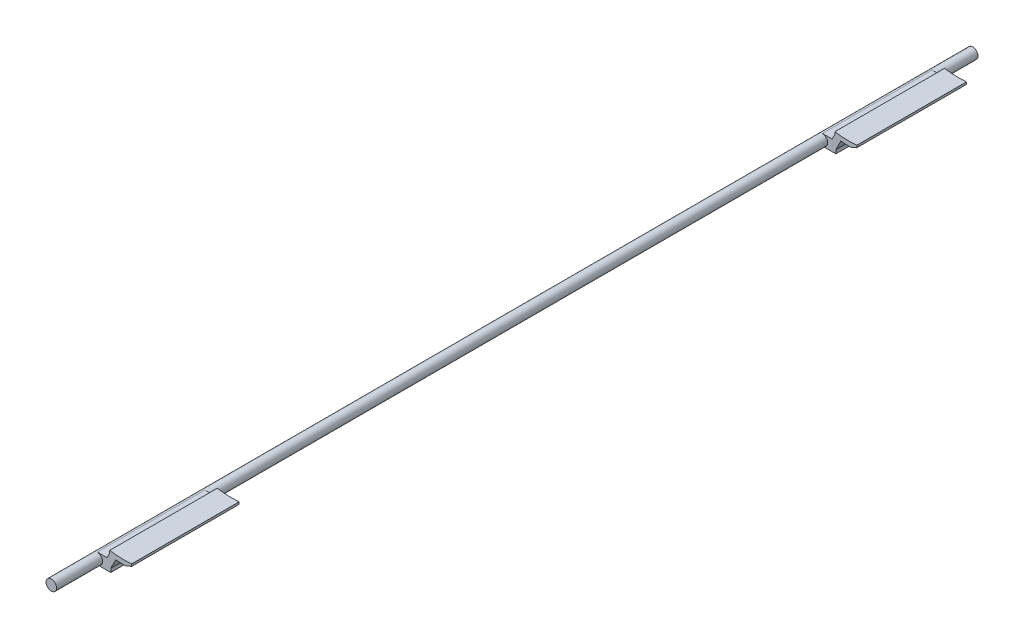
ISO-10303-21;
HEADER;
FILE_DESCRIPTION(('STEP AP214'),'2;1');
FILE_NAME('part.step','',(''),(''),'','','');
FILE_SCHEMA(('AUTOMOTIVE_DESIGN { 1 0 10303 214 1 1 1 1 }'));
ENDSEC;
DATA;
#1=APPLICATION_CONTEXT('core data for automotive mechanical design processes');
#2=APPLICATION_PROTOCOL_DEFINITION('international standard','automotive_design',2000,#1);
#3=PRODUCT_CONTEXT('',#1,'mechanical');
#4=PRODUCT('Part','Part','',(#3));
#5=PRODUCT_RELATED_PRODUCT_CATEGORY('part','',(#4));
#6=PRODUCT_DEFINITION_FORMATION('','',#4);
#7=PRODUCT_DEFINITION_CONTEXT('part definition',#1,'design');
#8=PRODUCT_DEFINITION('design','',#6,#7);
#9=PRODUCT_DEFINITION_SHAPE('','',#8);
#10=(LENGTH_UNIT() NAMED_UNIT(*) SI_UNIT(.MILLI.,.METRE.));
#11=(NAMED_UNIT(*) PLANE_ANGLE_UNIT() SI_UNIT($,.RADIAN.));
#12=(NAMED_UNIT(*) SI_UNIT($,.STERADIAN.) SOLID_ANGLE_UNIT());
#13=UNCERTAINTY_MEASURE_WITH_UNIT(LENGTH_MEASURE(1.E-05),#10,'distance_accuracy_value','');
#14=(GEOMETRIC_REPRESENTATION_CONTEXT(3) GLOBAL_UNCERTAINTY_ASSIGNED_CONTEXT((#13)) GLOBAL_UNIT_ASSIGNED_CONTEXT((#10,
#11,#12)) REPRESENTATION_CONTEXT('',''));
#15=CARTESIAN_POINT('',(0.,0.,0.));
#16=DIRECTION('',(0.,0.,1.));
#17=DIRECTION('',(1.,0.,0.));
#18=AXIS2_PLACEMENT_3D('',#15,#16,#17);
#19=CARTESIAN_POINT('',(-12.,-45.0038053254239,70.));
#20=DIRECTION('',(0.,0.,-1.));
#21=DIRECTION('',(-1.,0.,0.));
#22=AXIS2_PLACEMENT_3D('',#19,#20,#21);
#23=CYLINDRICAL_SURFACE('',#22,2.4);
#24=CARTESIAN_POINT('',(-12.,-45.0038053254239,-331.5));
#25=DIRECTION('',(0.,0.,1.));
#26=DIRECTION('',(-1.,0.,0.));
#27=AXIS2_PLACEMENT_3D('',#24,#25,#26);
#28=CIRCLE('',#27,2.4);
#29=CARTESIAN_POINT('',(-12.,-47.4038053254239,-331.5));
#30=VERTEX_POINT('',#29);
#31=CARTESIAN_POINT('',(-12.,-42.6038053254239,-331.5));
#32=VERTEX_POINT('',#31);
#33=EDGE_CURVE('E270',#30,#32,#28,.T.);
#34=ORIENTED_EDGE('',*,*,#33,.F.);
#35=DIRECTION('',(0.,0.,1.));
#36=VECTOR('',#35,1.);
#37=CARTESIAN_POINT('',(-12.,-47.4038053254239,-331.5));
#38=LINE('',#37,#36);
#39=CARTESIAN_POINT('',(-12.,-47.4038053254239,-281.5));
#40=VERTEX_POINT('',#39);
#41=EDGE_CURVE('E348',#30,#40,#38,.T.);
#42=ORIENTED_EDGE('',*,*,#41,.T.);
#43=CARTESIAN_POINT('',(-12.,-45.0038053254239,-281.5));
#44=DIRECTION('',(0.,0.,1.));
#45=DIRECTION('',(-1.,0.,0.));
#46=AXIS2_PLACEMENT_3D('',#43,#44,#45);
#47=CIRCLE('',#46,2.4);
#48=CARTESIAN_POINT('',(-12.,-42.6038053254239,-281.5));
#49=VERTEX_POINT('',#48);
#50=EDGE_CURVE('E294',#40,#49,#47,.T.);
#51=ORIENTED_EDGE('',*,*,#50,.T.);
#52=DIRECTION('',(0.,0.,1.));
#53=VECTOR('',#52,1.);
#54=CARTESIAN_POINT('',(-12.,-42.6038053254239,-331.5));
#55=LINE('',#54,#53);
#56=EDGE_CURVE('E345',#32,#49,#55,.T.);
#57=ORIENTED_EDGE('',*,*,#56,.F.);
#58=EDGE_LOOP('',(#34,#42,#51,#57));
#59=FACE_BOUND('',#58,.T.);
#60=CARTESIAN_POINT('',(-12.,-45.0038053254239,49.));
#61=DIRECTION('',(0.,0.,1.));
#62=DIRECTION('',(1.,0.,0.));
#63=AXIS2_PLACEMENT_3D('',#60,#61,#62);
#64=CIRCLE('',#63,2.4);
#65=CARTESIAN_POINT('',(-12.,-47.4038053254239,49.));
#66=VERTEX_POINT('',#65);
#67=CARTESIAN_POINT('',(-12.,-42.6038053254239,49.));
#68=VERTEX_POINT('',#67);
#69=EDGE_CURVE('E362',#66,#68,#64,.T.);
#70=ORIENTED_EDGE('',*,*,#69,.T.);
#71=DIRECTION('',(0.,0.,-1.));
#72=VECTOR('',#71,1.);
#73=CARTESIAN_POINT('',(-12.,-42.6038053254239,70.));
#74=LINE('',#73,#72);
#75=CARTESIAN_POINT('',(-12.,-42.6038053254239,0.));
#76=VERTEX_POINT('',#75);
#77=EDGE_CURVE('E11',#68,#76,#74,.T.);
#78=ORIENTED_EDGE('',*,*,#77,.T.);
#79=CARTESIAN_POINT('',(-12.,-45.0038053254239,0.));
#80=DIRECTION('',(0.,0.,1.));
#81=DIRECTION('',(1.,0.,0.));
#82=AXIS2_PLACEMENT_3D('',#79,#80,#81);
#83=CIRCLE('',#82,2.4);
#84=CARTESIAN_POINT('',(-12.,-47.4038053254239,0.));
#85=VERTEX_POINT('',#84);
#86=EDGE_CURVE('E360',#85,#76,#83,.T.);
#87=ORIENTED_EDGE('',*,*,#86,.F.);
#88=DIRECTION('',(0.,0.,-1.));
#89=VECTOR('',#88,1.);
#90=CARTESIAN_POINT('',(-12.,-47.4038053254239,70.));
#91=LINE('',#90,#89);
#92=EDGE_CURVE('E46',#85,#66,#91,.F.);
#93=ORIENTED_EDGE('',*,*,#92,.T.);
#94=EDGE_LOOP('',(#70,#78,#87,#93));
#95=FACE_BOUND('',#94,.T.);
#96=CARTESIAN_POINT('',(-12.,-45.0038053254239,70.));
#97=DIRECTION('',(0.,0.,-1.));
#98=DIRECTION('',(-1.,0.,0.));
#99=AXIS2_PLACEMENT_3D('',#96,#97,#98);
#100=CIRCLE('',#99,2.4);
#101=CARTESIAN_POINT('',(-14.4,-45.0038053254239,70.));
#102=VERTEX_POINT('',#101);
#103=EDGE_CURVE('E357',#102,#102,#100,.T.);
#104=ORIENTED_EDGE('',*,*,#103,.T.);
#105=EDGE_LOOP('',(#104));
#106=FACE_BOUND('',#105,.T.);
#107=CARTESIAN_POINT('',(-12.,-45.0038053254239,-350.));
#108=DIRECTION('',(0.,0.,-1.));
#109=DIRECTION('',(-1.,0.,0.));
#110=AXIS2_PLACEMENT_3D('',#107,#108,#109);
#111=CIRCLE('',#110,2.4);
#112=CARTESIAN_POINT('',(-14.4,-45.0038053254239,-350.));
#113=VERTEX_POINT('',#112);
#114=EDGE_CURVE('E354',#113,#113,#111,.T.);
#115=ORIENTED_EDGE('',*,*,#114,.F.);
#116=EDGE_LOOP('',(#115));
#117=FACE_BOUND('',#116,.T.);
#118=CARTESIAN_POINT('',(-12.,-45.0038053254239,-142.75));
#119=DIRECTION('',(0.,0.,1.));
#120=DIRECTION('',(-1.,0.,0.));
#121=AXIS2_PLACEMENT_3D('',#118,#119,#120);
#122=CIRCLE('',#121,2.4);
#123=CARTESIAN_POINT('',(-14.1477070839968,-46.0749515719047,-142.75));
#124=VERTEX_POINT('',#123);
#125=CARTESIAN_POINT('',(-11.6077130988425,-47.37152806831,-142.75));
#126=VERTEX_POINT('',#125);
#127=EDGE_CURVE('E53',#124,#126,#122,.T.);
#128=ORIENTED_EDGE('',*,*,#127,.F.);
#129=DIRECTION('',(0.,0.,1.));
#130=VECTOR('',#129,1.);
#131=CARTESIAN_POINT('',(-14.1477070839968,-46.0749515719047,-142.75));
#132=LINE('',#131,#130);
#133=CARTESIAN_POINT('',(-14.1477070839968,-46.0749515719047,-140.75));
#134=VERTEX_POINT('',#133);
#135=EDGE_CURVE('E58',#124,#134,#132,.T.);
#136=ORIENTED_EDGE('',*,*,#135,.T.);
#137=CARTESIAN_POINT('',(-12.,-45.0038053254239,-140.75));
#138=DIRECTION('',(0.,0.,1.));
#139=DIRECTION('',(-1.,0.,0.));
#140=AXIS2_PLACEMENT_3D('',#137,#138,#139);
#141=CIRCLE('',#140,2.4);
#142=CARTESIAN_POINT('',(-11.6077130988425,-47.37152806831,-140.75));
#143=VERTEX_POINT('',#142);
#144=EDGE_CURVE('E627',#134,#143,#141,.T.);
#145=ORIENTED_EDGE('',*,*,#144,.T.);
#146=DIRECTION('',(0.,0.,1.));
#147=VECTOR('',#146,1.);
#148=CARTESIAN_POINT('',(-11.6077130988425,-47.37152806831,-142.75));
#149=LINE('',#148,#147);
#150=EDGE_CURVE('E260',#126,#143,#149,.T.);
#151=ORIENTED_EDGE('',*,*,#150,.F.);
#152=EDGE_LOOP('',(#128,#136,#145,#151));
#153=FACE_BOUND('',#152,.T.);
#154=ADVANCED_FACE('F37',(#59,#95,#106,#117,#153),#23,.T.);
#155=CARTESIAN_POINT('',(-12.,0.,0.));
#156=DIRECTION('',(-1.,0.,0.));
#157=DIRECTION('',(0.,0.,1.));
#158=AXIS2_PLACEMENT_3D('',#155,#156,#157);
#159=PLANE('',#158);
#160=ORIENTED_EDGE('',*,*,#77,.F.);
#161=DIRECTION('',(0.,-1.,0.));
#162=VECTOR('',#161,1.);
#163=CARTESIAN_POINT('',(-12.,-42.5038053254239,49.));
#164=LINE('',#163,#162);
#165=CARTESIAN_POINT('',(-12.,-42.5038053254239,49.));
#166=VERTEX_POINT('',#165);
#167=EDGE_CURVE('E382',#166,#68,#164,.T.);
#168=ORIENTED_EDGE('',*,*,#167,.F.);
#169=DIRECTION('',(0.,0.,1.));
#170=VECTOR('',#169,1.);
#171=CARTESIAN_POINT('',(-12.,-42.5038053254239,0.));
#172=LINE('',#171,#170);
#173=CARTESIAN_POINT('',(-12.,-42.5038053254239,0.));
#174=VERTEX_POINT('',#173);
#175=EDGE_CURVE('E378',#174,#166,#172,.T.);
#176=ORIENTED_EDGE('',*,*,#175,.F.);
#177=DIRECTION('',(0.,1.,0.));
#178=VECTOR('',#177,1.);
#179=CARTESIAN_POINT('',(-12.,-42.5038053254239,0.));
#180=LINE('',#179,#178);
#181=EDGE_CURVE('E365',#76,#174,#180,.T.);
#182=ORIENTED_EDGE('',*,*,#181,.F.);
#183=EDGE_LOOP('',(#160,#168,#176,#182));
#184=FACE_BOUND('',#183,.T.);
#185=ADVANCED_FACE('F478',(#184),#159,.T.);
#186=CARTESIAN_POINT('',(-8.5584908278383,-44.4973356573606,49.));
#187=DIRECTION('',(0.897224309500206,-0.441575065466652,0.));
#188=DIRECTION('',(0.441575065466652,0.897224309500206,0.));
#189=AXIS2_PLACEMENT_3D('',#186,#187,#188);
#190=PLANE('',#189);
#191=DIRECTION('',(0.,0.,-1.));
#192=VECTOR('',#191,1.);
#193=CARTESIAN_POINT('',(-7.57736127359667,-42.5038053254239,49.));
#194=LINE('',#193,#192);
#195=CARTESIAN_POINT('',(-7.57736127359666,-42.5038053254239,49.));
#196=VERTEX_POINT('',#195);
#197=CARTESIAN_POINT('',(-7.57736127359666,-42.5038053254239,0.));
#198=VERTEX_POINT('',#197);
#199=EDGE_CURVE('E450',#196,#198,#194,.T.);
#200=ORIENTED_EDGE('',*,*,#199,.F.);
#201=DIRECTION('',(0.441575065466652,0.897224309500206,0.));
#202=VECTOR('',#201,1.);
#203=CARTESIAN_POINT('',(-8.5584908278383,-44.4973356573606,49.));
#204=LINE('',#203,#202);
#205=CARTESIAN_POINT('',(-6.35061550050504,-40.0112141098596,49.));
#206=VERTEX_POINT('',#205);
#207=EDGE_CURVE('E403',#196,#206,#204,.T.);
#208=ORIENTED_EDGE('',*,*,#207,.T.);
#209=DIRECTION('',(0.,0.,1.));
#210=VECTOR('',#209,1.);
#211=CARTESIAN_POINT('',(-6.35061550050505,-40.0112141098596,49.));
#212=LINE('',#211,#210);
#213=CARTESIAN_POINT('',(-6.35061550050504,-40.0112141098596,0.));
#214=VERTEX_POINT('',#213);
#215=EDGE_CURVE('E447',#214,#206,#212,.T.);
#216=ORIENTED_EDGE('',*,*,#215,.F.);
#217=DIRECTION('',(0.441575065466652,0.897224309500206,0.));
#218=VECTOR('',#217,1.);
#219=CARTESIAN_POINT('',(-8.5584908278383,-44.4973356573606,0.));
#220=LINE('',#219,#218);
#221=EDGE_CURVE('E401',#198,#214,#220,.T.);
#222=ORIENTED_EDGE('',*,*,#221,.F.);
#223=EDGE_LOOP('',(#200,#208,#216,#222));
#224=FACE_BOUND('',#223,.T.);
#225=ADVANCED_FACE('F483',(#224),#190,.F.);
#226=CARTESIAN_POINT('',(0.,0.,49.));
#227=DIRECTION('',(0.,0.,-1.));
#228=DIRECTION('',(-1.,0.,0.));
#229=AXIS2_PLACEMENT_3D('',#226,#227,#228);
#230=CYLINDRICAL_SURFACE('',#229,39.5);
#231=CARTESIAN_POINT('',(0.,0.,0.));
#232=DIRECTION('',(0.,0.,-1.));
#233=DIRECTION('',(1.,0.,0.));
#234=AXIS2_PLACEMENT_3D('',#231,#232,#233);
#235=CIRCLE('',#234,39.5);
#236=CARTESIAN_POINT('',(3.64938449949495,-39.3310563394227,0.));
#237=VERTEX_POINT('',#236);
#238=CARTESIAN_POINT('',(-6.35061550050505,-38.9861473188201,0.));
#239=VERTEX_POINT('',#238);
#240=EDGE_CURVE('E407',#237,#239,#235,.T.);
#241=ORIENTED_EDGE('',*,*,#240,.T.);
#242=DIRECTION('',(0.,0.,-1.));
#243=VECTOR('',#242,1.);
#244=CARTESIAN_POINT('',(-6.35061550050505,-38.9861473188201,49.));
#245=LINE('',#244,#243);
#246=CARTESIAN_POINT('',(-6.35061550050505,-38.9861473188201,49.));
#247=VERTEX_POINT('',#246);
#248=EDGE_CURVE('E430',#247,#239,#245,.T.);
#249=ORIENTED_EDGE('',*,*,#248,.F.);
#250=CARTESIAN_POINT('',(0.,0.,49.));
#251=DIRECTION('',(0.,0.,-1.));
#252=DIRECTION('',(1.,0.,0.));
#253=AXIS2_PLACEMENT_3D('',#250,#251,#252);
#254=CIRCLE('',#253,39.5);
#255=CARTESIAN_POINT('',(3.64938449949495,-39.3310563394227,49.));
#256=VERTEX_POINT('',#255);
#257=EDGE_CURVE('E408',#256,#247,#254,.T.);
#258=ORIENTED_EDGE('',*,*,#257,.F.);
#259=DIRECTION('',(0.,0.,-1.));
#260=VECTOR('',#259,1.);
#261=CARTESIAN_POINT('',(3.64938449949495,-39.3310563394227,49.));
#262=LINE('',#261,#260);
#263=EDGE_CURVE('E419',#256,#237,#262,.T.);
#264=ORIENTED_EDGE('',*,*,#263,.T.);
#265=EDGE_LOOP('',(#241,#249,#258,#264));
#266=FACE_BOUND('',#265,.T.);
#267=ADVANCED_FACE('F492',(#266),#230,.F.);
#268=CARTESIAN_POINT('',(-6.35061550050505,-38.9861473188201,49.));
#269=DIRECTION('',(1.,0.,0.));
#270=DIRECTION('',(0.,0.,-1.));
#271=AXIS2_PLACEMENT_3D('',#268,#269,#270);
#272=PLANE('',#271);
#273=DIRECTION('',(0.,-1.,0.));
#274=VECTOR('',#273,1.);
#275=CARTESIAN_POINT('',(-6.35061550050505,-38.9861473188201,0.));
#276=LINE('',#275,#274);
#277=EDGE_CURVE('E422',#239,#214,#276,.T.);
#278=ORIENTED_EDGE('',*,*,#277,.T.);
#279=ORIENTED_EDGE('',*,*,#215,.T.);
#280=DIRECTION('',(0.,-1.,0.));
#281=VECTOR('',#280,1.);
#282=CARTESIAN_POINT('',(-6.35061550050505,-38.9861473188201,49.));
#283=LINE('',#282,#281);
#284=EDGE_CURVE('E411',#247,#206,#283,.T.);
#285=ORIENTED_EDGE('',*,*,#284,.F.);
#286=ORIENTED_EDGE('',*,*,#248,.T.);
#287=EDGE_LOOP('',(#278,#279,#285,#286));
#288=FACE_BOUND('',#287,.T.);
#289=ADVANCED_FACE('F488',(#288),#272,.F.);
#290=CARTESIAN_POINT('',(0.,0.,49.));
#291=DIRECTION('',(0.,0.,-1.));
#292=DIRECTION('',(-1.,0.,0.));
#293=AXIS2_PLACEMENT_3D('',#290,#291,#292);
#294=CYLINDRICAL_SURFACE('',#293,41.5);
#295=CARTESIAN_POINT('',(0.,0.,49.));
#296=DIRECTION('',(0.,0.,1.));
#297=DIRECTION('',(1.,0.,0.));
#298=AXIS2_PLACEMENT_3D('',#295,#296,#297);
#299=CIRCLE('',#298,41.5);
#300=CARTESIAN_POINT('',(-3.65288271390052,-41.3389217067703,49.));
#301=VERTEX_POINT('',#300);
#302=CARTESIAN_POINT('',(0.929260094521954,-41.4895947880517,49.));
#303=VERTEX_POINT('',#302);
#304=EDGE_CURVE('E415',#301,#303,#299,.T.);
#305=ORIENTED_EDGE('',*,*,#304,.F.);
#306=DIRECTION('',(0.,0.,-1.));
#307=VECTOR('',#306,1.);
#308=CARTESIAN_POINT('',(-3.65288271390053,-41.3389217067703,49.));
#309=LINE('',#308,#307);
#310=CARTESIAN_POINT('',(-3.65288271390053,-41.3389217067703,0.));
#311=VERTEX_POINT('',#310);
#312=EDGE_CURVE('E444',#301,#311,#309,.T.);
#313=ORIENTED_EDGE('',*,*,#312,.T.);
#314=CARTESIAN_POINT('',(0.,0.,0.));
#315=DIRECTION('',(0.,0.,1.));
#316=DIRECTION('',(1.,0.,0.));
#317=AXIS2_PLACEMENT_3D('',#314,#315,#316);
#318=CIRCLE('',#317,41.5);
#319=CARTESIAN_POINT('',(0.929260094521954,-41.4895947880517,0.));
#320=VERTEX_POINT('',#319);
#321=EDGE_CURVE('E425',#311,#320,#318,.T.);
#322=ORIENTED_EDGE('',*,*,#321,.T.);
#323=DIRECTION('',(0.,0.,-1.));
#324=VECTOR('',#323,1.);
#325=CARTESIAN_POINT('',(0.929260094521954,-41.4895947880517,49.));
#326=LINE('',#325,#324);
#327=EDGE_CURVE('E439',#320,#303,#326,.F.);
#328=ORIENTED_EDGE('',*,*,#327,.T.);
#329=EDGE_LOOP('',(#305,#313,#322,#328));
#330=FACE_BOUND('',#329,.T.);
#331=ADVANCED_FACE('F505',(#330),#294,.T.);
#332=CARTESIAN_POINT('',(3.64938449949495,-39.3310563394227,49.));
#333=DIRECTION('',(-1.,0.,0.));
#334=DIRECTION('',(0.,-1.,0.));
#335=AXIS2_PLACEMENT_3D('',#332,#333,#334);
#336=PLANE('',#335);
#337=DIRECTION('',(0.,1.,0.));
#338=VECTOR('',#337,1.);
#339=CARTESIAN_POINT('',(3.64938449949495,-39.3310563394227,49.));
#340=LINE('',#339,#338);
#341=CARTESIAN_POINT('',(3.64938449949495,-40.3392306746854,49.));
#342=VERTEX_POINT('',#341);
#343=EDGE_CURVE('E417',#342,#256,#340,.T.);
#344=ORIENTED_EDGE('',*,*,#343,.F.);
#345=DIRECTION('',(0.,0.,-1.));
#346=VECTOR('',#345,1.);
#347=CARTESIAN_POINT('',(3.64938449949495,-40.3392306746854,49.));
#348=LINE('',#347,#346);
#349=CARTESIAN_POINT('',(3.64938449949495,-40.3392306746854,0.));
#350=VERTEX_POINT('',#349);
#351=EDGE_CURVE('E433',#342,#350,#348,.T.);
#352=ORIENTED_EDGE('',*,*,#351,.T.);
#353=DIRECTION('',(0.,1.,0.));
#354=VECTOR('',#353,1.);
#355=CARTESIAN_POINT('',(3.64938449949495,-39.3310563394227,0.));
#356=LINE('',#355,#354);
#357=EDGE_CURVE('E412',#350,#237,#356,.T.);
#358=ORIENTED_EDGE('',*,*,#357,.T.);
#359=ORIENTED_EDGE('',*,*,#263,.F.);
#360=EDGE_LOOP('',(#344,#352,#358,#359));
#361=FACE_BOUND('',#360,.T.);
#362=ADVANCED_FACE('F496',(#361),#336,.F.);
#363=CARTESIAN_POINT('',(0.,0.,49.));
#364=DIRECTION('',(0.,0.,1.));
#365=DIRECTION('',(1.,0.,0.));
#366=AXIS2_PLACEMENT_3D('',#363,#364,#365);
#367=PLANE('',#366);
#368=ORIENTED_EDGE('',*,*,#69,.F.);
#369=CARTESIAN_POINT('',(-12.,-47.5038053254239,49.));
#370=VERTEX_POINT('',#369);
#371=EDGE_CURVE('E381',#66,#370,#164,.T.);
#372=ORIENTED_EDGE('',*,*,#371,.T.);
#373=DIRECTION('',(-1.,0.,0.));
#374=VECTOR('',#373,1.);
#375=CARTESIAN_POINT('',(-5.86075804123378,-47.5038053254239,49.));
#376=LINE('',#375,#374);
#377=CARTESIAN_POINT('',(-5.86075804123378,-47.5038053254239,49.));
#378=VERTEX_POINT('',#377);
#379=EDGE_CURVE('E388',#378,#370,#376,.T.);
#380=ORIENTED_EDGE('',*,*,#379,.F.);
#381=DIRECTION('',(0.,-1.,0.));
#382=VECTOR('',#381,1.);
#383=CARTESIAN_POINT('',(-5.86075804123378,-42.5038053254239,49.));
#384=LINE('',#383,#382);
#385=CARTESIAN_POINT('',(-5.86075804123378,-45.8250432542713,49.));
#386=VERTEX_POINT('',#385);
#387=EDGE_CURVE('E369',#386,#378,#384,.T.);
#388=ORIENTED_EDGE('',*,*,#387,.F.);
#389=DIRECTION('',(0.441575065466652,0.897224309500206,0.));
#390=VECTOR('',#389,1.);
#391=CARTESIAN_POINT('',(-5.86075804123378,-45.8250432542713,49.));
#392=LINE('',#391,#390);
#393=EDGE_CURVE('E405',#386,#301,#392,.T.);
#394=ORIENTED_EDGE('',*,*,#393,.T.);
#395=ORIENTED_EDGE('',*,*,#304,.T.);
#396=DIRECTION('',(-0.921022860019128,-0.38950852535238,0.));
#397=VECTOR('',#396,1.);
#398=CARTESIAN_POINT('',(15.0252212468492,-35.5282910243717,49.));
#399=LINE('',#398,#397);
#400=EDGE_CURVE('E442',#303,#342,#399,.F.);
#401=ORIENTED_EDGE('',*,*,#400,.T.);
#402=ORIENTED_EDGE('',*,*,#343,.T.);
#403=ORIENTED_EDGE('',*,*,#257,.T.);
#404=ORIENTED_EDGE('',*,*,#284,.T.);
#405=ORIENTED_EDGE('',*,*,#207,.F.);
#406=DIRECTION('',(-1.,0.,0.));
#407=VECTOR('',#406,1.);
#408=CARTESIAN_POINT('',(-5.86075804123378,-42.5038053254239,49.));
#409=LINE('',#408,#407);
#410=EDGE_CURVE('E391',#196,#166,#409,.T.);
#411=ORIENTED_EDGE('',*,*,#410,.T.);
#412=ORIENTED_EDGE('',*,*,#167,.T.);
#413=EDGE_LOOP('',(#368,#372,#380,#388,#394,#395,#401,#402,#403,#404,#405,#411,#412));
#414=FACE_BOUND('',#413,.T.);
#415=ADVANCED_FACE('F472',(#414),#367,.T.);
#416=CARTESIAN_POINT('',(0.,0.,0.));
#417=DIRECTION('',(0.,0.,1.));
#418=DIRECTION('',(1.,0.,0.));
#419=AXIS2_PLACEMENT_3D('',#416,#417,#418);
#420=PLANE('',#419);
#421=CARTESIAN_POINT('',(-12.,-47.5038053254239,0.));
#422=VERTEX_POINT('',#421);
#423=EDGE_CURVE('E375',#422,#85,#180,.T.);
#424=ORIENTED_EDGE('',*,*,#423,.T.);
#425=ORIENTED_EDGE('',*,*,#86,.T.);
#426=ORIENTED_EDGE('',*,*,#181,.T.);
#427=DIRECTION('',(-1.,0.,0.));
#428=VECTOR('',#427,1.);
#429=CARTESIAN_POINT('',(-5.86075804123378,-42.5038053254239,0.));
#430=LINE('',#429,#428);
#431=EDGE_CURVE('E393',#198,#174,#430,.T.);
#432=ORIENTED_EDGE('',*,*,#431,.F.);
#433=ORIENTED_EDGE('',*,*,#221,.T.);
#434=ORIENTED_EDGE('',*,*,#277,.F.);
#435=ORIENTED_EDGE('',*,*,#240,.F.);
#436=ORIENTED_EDGE('',*,*,#357,.F.);
#437=DIRECTION('',(0.921022860019128,0.38950852535238,0.));
#438=VECTOR('',#437,1.);
#439=CARTESIAN_POINT('',(3.64938449949495,-40.3392306746854,0.));
#440=LINE('',#439,#438);
#441=EDGE_CURVE('E436',#350,#320,#440,.F.);
#442=ORIENTED_EDGE('',*,*,#441,.T.);
#443=ORIENTED_EDGE('',*,*,#321,.F.);
#444=DIRECTION('',(0.441575065466652,0.897224309500206,0.));
#445=VECTOR('',#444,1.);
#446=CARTESIAN_POINT('',(-5.86075804123378,-45.8250432542713,0.));
#447=LINE('',#446,#445);
#448=CARTESIAN_POINT('',(-5.86075804123378,-45.8250432542713,0.));
#449=VERTEX_POINT('',#448);
#450=EDGE_CURVE('E399',#449,#311,#447,.T.);
#451=ORIENTED_EDGE('',*,*,#450,.F.);
#452=DIRECTION('',(0.,1.,0.));
#453=VECTOR('',#452,1.);
#454=CARTESIAN_POINT('',(-5.86075804123378,-42.5038053254239,0.));
#455=LINE('',#454,#453);
#456=CARTESIAN_POINT('',(-5.86075804123378,-47.5038053254239,0.));
#457=VERTEX_POINT('',#456);
#458=EDGE_CURVE('E366',#457,#449,#455,.T.);
#459=ORIENTED_EDGE('',*,*,#458,.F.);
#460=DIRECTION('',(-1.,0.,0.));
#461=VECTOR('',#460,1.);
#462=CARTESIAN_POINT('',(-5.86075804123378,-47.5038053254239,0.));
#463=LINE('',#462,#461);
#464=EDGE_CURVE('E374',#457,#422,#463,.T.);
#465=ORIENTED_EDGE('',*,*,#464,.T.);
#466=EDGE_LOOP('',(#424,#425,#426,#432,#433,#434,#435,#436,#442,#443,#451,#459,#465));
#467=FACE_BOUND('',#466,.T.);
#468=ADVANCED_FACE('F462',(#467),#420,.F.);
#469=CARTESIAN_POINT('',(3.64938449949495,-40.3392306746854,49.));
#470=DIRECTION('',(-0.38950852535238,0.921022860019128,0.));
#471=DIRECTION('',(0.,0.,-1.));
#472=AXIS2_PLACEMENT_3D('',#469,#470,#471);
#473=PLANE('',#472);
#474=ORIENTED_EDGE('',*,*,#400,.F.);
#475=ORIENTED_EDGE('',*,*,#327,.F.);
#476=ORIENTED_EDGE('',*,*,#441,.F.);
#477=ORIENTED_EDGE('',*,*,#351,.F.);
#478=EDGE_LOOP('',(#474,#475,#476,#477));
#479=FACE_BOUND('',#478,.T.);
#480=ADVANCED_FACE('F40',(#479),#473,.F.);
#481=CARTESIAN_POINT('',(-5.86075804123378,-45.8250432542713,0.));
#482=DIRECTION('',(-0.897224309500206,0.441575065466652,0.));
#483=DIRECTION('',(-0.441575065466652,-0.897224309500206,0.));
#484=AXIS2_PLACEMENT_3D('',#481,#482,#483);
#485=PLANE('',#484);
#486=ORIENTED_EDGE('',*,*,#312,.F.);
#487=ORIENTED_EDGE('',*,*,#393,.F.);
#488=DIRECTION('',(0.,0.,1.));
#489=VECTOR('',#488,1.);
#490=CARTESIAN_POINT('',(-5.86075804123378,-45.8250432542713,0.));
#491=LINE('',#490,#489);
#492=EDGE_CURVE('E396',#449,#386,#491,.T.);
#493=ORIENTED_EDGE('',*,*,#492,.F.);
#494=ORIENTED_EDGE('',*,*,#450,.T.);
#495=EDGE_LOOP('',(#486,#487,#493,#494));
#496=FACE_BOUND('',#495,.T.);
#497=ADVANCED_FACE('F508',(#496),#485,.F.);
#498=CARTESIAN_POINT('',(-5.86075804123378,-42.5038053254239,0.));
#499=DIRECTION('',(0.,-1.,0.));
#500=DIRECTION('',(0.,0.,-1.));
#501=AXIS2_PLACEMENT_3D('',#498,#499,#500);
#502=PLANE('',#501);
#503=ORIENTED_EDGE('',*,*,#410,.F.);
#504=ORIENTED_EDGE('',*,*,#199,.T.);
#505=ORIENTED_EDGE('',*,*,#431,.T.);
#506=ORIENTED_EDGE('',*,*,#175,.T.);
#507=EDGE_LOOP('',(#503,#504,#505,#506));
#508=FACE_BOUND('',#507,.T.);
#509=ADVANCED_FACE('F481',(#508),#502,.F.);
#510=CARTESIAN_POINT('',(-5.86075804123378,-47.5038053254239,0.));
#511=DIRECTION('',(0.,1.,0.));
#512=DIRECTION('',(0.,0.,1.));
#513=AXIS2_PLACEMENT_3D('',#510,#511,#512);
#514=PLANE('',#513);
#515=DIRECTION('',(0.,0.,-1.));
#516=VECTOR('',#515,1.);
#517=CARTESIAN_POINT('',(-12.,-47.5038053254239,0.));
#518=LINE('',#517,#516);
#519=EDGE_CURVE('E370',#370,#422,#518,.T.);
#520=ORIENTED_EDGE('',*,*,#519,.T.);
#521=ORIENTED_EDGE('',*,*,#464,.F.);
#522=DIRECTION('',(0.,0.,-1.));
#523=VECTOR('',#522,1.);
#524=CARTESIAN_POINT('',(-5.86075804123378,-47.5038053254239,0.));
#525=LINE('',#524,#523);
#526=EDGE_CURVE('E372',#378,#457,#525,.T.);
#527=ORIENTED_EDGE('',*,*,#526,.F.);
#528=ORIENTED_EDGE('',*,*,#379,.T.);
#529=EDGE_LOOP('',(#520,#521,#527,#528));
#530=FACE_BOUND('',#529,.T.);
#531=ADVANCED_FACE('F468',(#530),#514,.F.);
#532=CARTESIAN_POINT('',(-5.86075804123378,0.,0.));
#533=DIRECTION('',(-1.,0.,0.));
#534=DIRECTION('',(0.,0.,1.));
#535=AXIS2_PLACEMENT_3D('',#532,#533,#534);
#536=PLANE('',#535);
#537=ORIENTED_EDGE('',*,*,#492,.T.);
#538=ORIENTED_EDGE('',*,*,#387,.T.);
#539=ORIENTED_EDGE('',*,*,#526,.T.);
#540=ORIENTED_EDGE('',*,*,#458,.T.);
#541=EDGE_LOOP('',(#537,#538,#539,#540));
#542=FACE_BOUND('',#541,.T.);
#543=ADVANCED_FACE('F510',(#542),#536,.F.);
#544=ORIENTED_EDGE('',*,*,#92,.F.);
#545=ORIENTED_EDGE('',*,*,#423,.F.);
#546=ORIENTED_EDGE('',*,*,#519,.F.);
#547=ORIENTED_EDGE('',*,*,#371,.F.);
#548=EDGE_LOOP('',(#544,#545,#546,#547));
#549=FACE_BOUND('',#548,.T.);
#550=ADVANCED_FACE('F459',(#549),#159,.T.);
#551=CARTESIAN_POINT('',(-12.,-45.0038053254239,70.));
#552=DIRECTION('',(0.,0.,-1.));
#553=DIRECTION('',(-1.,0.,0.));
#554=AXIS2_PLACEMENT_3D('',#551,#552,#553);
#555=PLANE('',#554);
#556=ORIENTED_EDGE('',*,*,#103,.F.);
#557=EDGE_LOOP('',(#556));
#558=FACE_BOUND('',#557,.T.);
#559=ADVANCED_FACE('F517',(#558),#555,.F.);
#560=CARTESIAN_POINT('',(-12.,-45.0038053254239,-350.));
#561=DIRECTION('',(0.,0.,-1.));
#562=DIRECTION('',(-1.,0.,0.));
#563=AXIS2_PLACEMENT_3D('',#560,#561,#562);
#564=PLANE('',#563);
#565=ORIENTED_EDGE('',*,*,#114,.T.);
#566=EDGE_LOOP('',(#565));
#567=FACE_BOUND('',#566,.T.);
#568=ADVANCED_FACE('F530',(#567),#564,.T.);
#569=CARTESIAN_POINT('',(-5.86075804123378,-47.5038053254239,-331.5));
#570=DIRECTION('',(0.,1.,0.));
#571=DIRECTION('',(0.,0.,1.));
#572=AXIS2_PLACEMENT_3D('',#569,#570,#571);
#573=PLANE('',#572);
#574=DIRECTION('',(-1.,0.,0.));
#575=VECTOR('',#574,1.);
#576=CARTESIAN_POINT('',(-5.86075804123378,-47.5038053254239,-281.5));
#577=LINE('',#576,#575);
#578=CARTESIAN_POINT('',(-5.86075804123378,-47.5038053254239,-281.5));
#579=VERTEX_POINT('',#578);
#580=CARTESIAN_POINT('',(-12.,-47.5038053254239,-281.5));
#581=VERTEX_POINT('',#580);
#582=EDGE_CURVE('E255',#579,#581,#577,.T.);
#583=ORIENTED_EDGE('',*,*,#582,.T.);
#584=DIRECTION('',(0.,0.,1.));
#585=VECTOR('',#584,1.);
#586=CARTESIAN_POINT('',(-12.,-47.5038053254239,-331.5));
#587=LINE('',#586,#585);
#588=CARTESIAN_POINT('',(-12.,-47.5038053254239,-331.5));
#589=VERTEX_POINT('',#588);
#590=EDGE_CURVE('E351',#589,#581,#587,.T.);
#591=ORIENTED_EDGE('',*,*,#590,.F.);
#592=DIRECTION('',(-1.,0.,0.));
#593=VECTOR('',#592,1.);
#594=CARTESIAN_POINT('',(-5.86075804123378,-47.5038053254239,-331.5));
#595=LINE('',#594,#593);
#596=CARTESIAN_POINT('',(-5.86075804123378,-47.5038053254239,-331.5));
#597=VERTEX_POINT('',#596);
#598=EDGE_CURVE('E264',#597,#589,#595,.T.);
#599=ORIENTED_EDGE('',*,*,#598,.F.);
#600=DIRECTION('',(0.,0.,1.));
#601=VECTOR('',#600,1.);
#602=CARTESIAN_POINT('',(-5.86075804123378,-47.5038053254239,-331.5));
#603=LINE('',#602,#601);
#604=EDGE_CURVE('E291',#597,#579,#603,.T.);
#605=ORIENTED_EDGE('',*,*,#604,.T.);
#606=EDGE_LOOP('',(#583,#591,#599,#605));
#607=FACE_BOUND('',#606,.T.);
#608=ADVANCED_FACE('F534',(#607),#573,.F.);
#609=CARTESIAN_POINT('',(-12.,-47.5038053254239,-331.5));
#610=DIRECTION('',(1.,0.,0.));
#611=DIRECTION('',(0.,0.,-1.));
#612=AXIS2_PLACEMENT_3D('',#609,#610,#611);
#613=PLANE('',#612);
#614=DIRECTION('',(0.,1.,0.));
#615=VECTOR('',#614,1.);
#616=CARTESIAN_POINT('',(-12.,-47.5038053254239,-281.5));
#617=LINE('',#616,#615);
#618=EDGE_CURVE('E258',#581,#40,#617,.T.);
#619=ORIENTED_EDGE('',*,*,#618,.T.);
#620=ORIENTED_EDGE('',*,*,#41,.F.);
#621=DIRECTION('',(0.,1.,0.));
#622=VECTOR('',#621,1.);
#623=CARTESIAN_POINT('',(-12.,-47.5038053254239,-331.5));
#624=LINE('',#623,#622);
#625=EDGE_CURVE('E267',#589,#30,#624,.T.);
#626=ORIENTED_EDGE('',*,*,#625,.F.);
#627=ORIENTED_EDGE('',*,*,#590,.T.);
#628=EDGE_LOOP('',(#619,#620,#626,#627));
#629=FACE_BOUND('',#628,.T.);
#630=ADVANCED_FACE('F538',(#629),#613,.F.);
#631=CARTESIAN_POINT('',(-12.,-42.6038053254239,-331.5));
#632=DIRECTION('',(1.,0.,0.));
#633=DIRECTION('',(0.,0.,-1.));
#634=AXIS2_PLACEMENT_3D('',#631,#632,#633);
#635=PLANE('',#634);
#636=DIRECTION('',(0.,1.,0.));
#637=VECTOR('',#636,1.);
#638=CARTESIAN_POINT('',(-12.,-42.6038053254239,-281.5));
#639=LINE('',#638,#637);
#640=CARTESIAN_POINT('',(-12.,-42.5038053254239,-281.5));
#641=VERTEX_POINT('',#640);
#642=EDGE_CURVE('E297',#49,#641,#639,.T.);
#643=ORIENTED_EDGE('',*,*,#642,.T.);
#644=DIRECTION('',(0.,0.,1.));
#645=VECTOR('',#644,1.);
#646=CARTESIAN_POINT('',(-12.,-42.5038053254239,-331.5));
#647=LINE('',#646,#645);
#648=CARTESIAN_POINT('',(-12.,-42.5038053254239,-331.5));
#649=VERTEX_POINT('',#648);
#650=EDGE_CURVE('E342',#649,#641,#647,.T.);
#651=ORIENTED_EDGE('',*,*,#650,.F.);
#652=DIRECTION('',(0.,1.,0.));
#653=VECTOR('',#652,1.);
#654=CARTESIAN_POINT('',(-12.,-42.6038053254239,-331.5));
#655=LINE('',#654,#653);
#656=EDGE_CURVE('E272',#32,#649,#655,.T.);
#657=ORIENTED_EDGE('',*,*,#656,.F.);
#658=ORIENTED_EDGE('',*,*,#56,.T.);
#659=EDGE_LOOP('',(#643,#651,#657,#658));
#660=FACE_BOUND('',#659,.T.);
#661=ADVANCED_FACE('F542',(#660),#635,.F.);
#662=CARTESIAN_POINT('',(-12.,-42.5038053254239,-331.5));
#663=DIRECTION('',(0.,-1.,0.));
#664=DIRECTION('',(0.,0.,-1.));
#665=AXIS2_PLACEMENT_3D('',#662,#663,#664);
#666=PLANE('',#665);
#667=DIRECTION('',(1.,0.,0.));
#668=VECTOR('',#667,1.);
#669=CARTESIAN_POINT('',(-12.,-42.5038053254239,-281.5));
#670=LINE('',#669,#668);
#671=CARTESIAN_POINT('',(-7.57736127359666,-42.5038053254239,-281.5));
#672=VERTEX_POINT('',#671);
#673=EDGE_CURVE('E299',#641,#672,#670,.T.);
#674=ORIENTED_EDGE('',*,*,#673,.T.);
#675=DIRECTION('',(0.,0.,1.));
#676=VECTOR('',#675,1.);
#677=CARTESIAN_POINT('',(-7.57736127359666,-42.5038053254239,-331.5));
#678=LINE('',#677,#676);
#679=CARTESIAN_POINT('',(-7.57736127359666,-42.5038053254239,-331.5));
#680=VERTEX_POINT('',#679);
#681=EDGE_CURVE('E339',#680,#672,#678,.T.);
#682=ORIENTED_EDGE('',*,*,#681,.F.);
#683=DIRECTION('',(1.,0.,0.));
#684=VECTOR('',#683,1.);
#685=CARTESIAN_POINT('',(-12.,-42.5038053254239,-331.5));
#686=LINE('',#685,#684);
#687=EDGE_CURVE('E274',#649,#680,#686,.T.);
#688=ORIENTED_EDGE('',*,*,#687,.F.);
#689=ORIENTED_EDGE('',*,*,#650,.T.);
#690=EDGE_LOOP('',(#674,#682,#688,#689));
#691=FACE_BOUND('',#690,.T.);
#692=ADVANCED_FACE('F546',(#691),#666,.F.);
#693=CARTESIAN_POINT('',(-7.57736127359666,-42.5038053254239,-331.5));
#694=DIRECTION('',(0.897224309500206,-0.441575065466652,0.));
#695=DIRECTION('',(0.441575065466652,0.897224309500207,0.));
#696=AXIS2_PLACEMENT_3D('',#693,#694,#695);
#697=PLANE('',#696);
#698=DIRECTION('',(0.441575065466652,0.897224309500206,0.));
#699=VECTOR('',#698,1.);
#700=CARTESIAN_POINT('',(-7.57736127359666,-42.5038053254239,-281.5));
#701=LINE('',#700,#699);
#702=CARTESIAN_POINT('',(-6.35061550050504,-40.0112141098596,-281.5));
#703=VERTEX_POINT('',#702);
#704=EDGE_CURVE('E301',#672,#703,#701,.T.);
#705=ORIENTED_EDGE('',*,*,#704,.T.);
#706=DIRECTION('',(0.,0.,1.));
#707=VECTOR('',#706,1.);
#708=CARTESIAN_POINT('',(-6.35061550050504,-40.0112141098596,-331.5));
#709=LINE('',#708,#707);
#710=CARTESIAN_POINT('',(-6.35061550050504,-40.0112141098596,-331.5));
#711=VERTEX_POINT('',#710);
#712=EDGE_CURVE('E336',#711,#703,#709,.T.);
#713=ORIENTED_EDGE('',*,*,#712,.F.);
#714=DIRECTION('',(0.441575065466652,0.897224309500206,0.));
#715=VECTOR('',#714,1.);
#716=CARTESIAN_POINT('',(-7.57736127359666,-42.5038053254239,-331.5));
#717=LINE('',#716,#715);
#718=EDGE_CURVE('E276',#680,#711,#717,.T.);
#719=ORIENTED_EDGE('',*,*,#718,.F.);
#720=ORIENTED_EDGE('',*,*,#681,.T.);
#721=EDGE_LOOP('',(#705,#713,#719,#720));
#722=FACE_BOUND('',#721,.T.);
#723=ADVANCED_FACE('F550',(#722),#697,.F.);
#724=CARTESIAN_POINT('',(-6.35061550050504,-40.0112141098596,-331.5));
#725=DIRECTION('',(1.,0.,0.));
#726=DIRECTION('',(0.,1.,0.));
#727=AXIS2_PLACEMENT_3D('',#724,#725,#726);
#728=PLANE('',#727);
#729=DIRECTION('',(0.,1.,0.));
#730=VECTOR('',#729,1.);
#731=CARTESIAN_POINT('',(-6.35061550050504,-40.0112141098596,-281.5));
#732=LINE('',#731,#730);
#733=CARTESIAN_POINT('',(-6.35061550050505,-38.9861473188201,-281.5));
#734=VERTEX_POINT('',#733);
#735=EDGE_CURVE('E303',#703,#734,#732,.T.);
#736=ORIENTED_EDGE('',*,*,#735,.T.);
#737=DIRECTION('',(0.,0.,1.));
#738=VECTOR('',#737,1.);
#739=CARTESIAN_POINT('',(-6.35061550050505,-38.9861473188201,-331.5));
#740=LINE('',#739,#738);
#741=CARTESIAN_POINT('',(-6.35061550050505,-38.9861473188201,-331.5));
#742=VERTEX_POINT('',#741);
#743=EDGE_CURVE('E333',#742,#734,#740,.T.);
#744=ORIENTED_EDGE('',*,*,#743,.F.);
#745=DIRECTION('',(0.,1.,0.));
#746=VECTOR('',#745,1.);
#747=CARTESIAN_POINT('',(-6.35061550050504,-40.0112141098596,-331.5));
#748=LINE('',#747,#746);
#749=EDGE_CURVE('E278',#711,#742,#748,.T.);
#750=ORIENTED_EDGE('',*,*,#749,.F.);
#751=ORIENTED_EDGE('',*,*,#712,.T.);
#752=EDGE_LOOP('',(#736,#744,#750,#751));
#753=FACE_BOUND('',#752,.T.);
#754=ADVANCED_FACE('F554',(#753),#728,.F.);
#755=CARTESIAN_POINT('',(0.,0.,-331.5));
#756=DIRECTION('',(0.,0.,1.));
#757=DIRECTION('',(1.,0.,0.));
#758=AXIS2_PLACEMENT_3D('',#755,#756,#757);
#759=CYLINDRICAL_SURFACE('',#758,39.5);
#760=CARTESIAN_POINT('',(0.,0.,-281.5));
#761=DIRECTION('',(0.,0.,1.));
#762=DIRECTION('',(-1.,0.,0.));
#763=AXIS2_PLACEMENT_3D('',#760,#761,#762);
#764=CIRCLE('',#763,39.5);
#765=CARTESIAN_POINT('',(3.64938449949495,-39.3310563394227,-281.5));
#766=VERTEX_POINT('',#765);
#767=EDGE_CURVE('E305',#734,#766,#764,.T.);
#768=ORIENTED_EDGE('',*,*,#767,.T.);
#769=DIRECTION('',(0.,0.,1.));
#770=VECTOR('',#769,1.);
#771=CARTESIAN_POINT('',(3.64938449949495,-39.3310563394227,-331.5));
#772=LINE('',#771,#770);
#773=CARTESIAN_POINT('',(3.64938449949495,-39.3310563394227,-331.5));
#774=VERTEX_POINT('',#773);
#775=EDGE_CURVE('E330',#774,#766,#772,.T.);
#776=ORIENTED_EDGE('',*,*,#775,.F.);
#777=CARTESIAN_POINT('',(0.,0.,-331.5));
#778=DIRECTION('',(0.,0.,1.));
#779=DIRECTION('',(-1.,0.,0.));
#780=AXIS2_PLACEMENT_3D('',#777,#778,#779);
#781=CIRCLE('',#780,39.5);
#782=EDGE_CURVE('E280',#742,#774,#781,.T.);
#783=ORIENTED_EDGE('',*,*,#782,.F.);
#784=ORIENTED_EDGE('',*,*,#743,.T.);
#785=EDGE_LOOP('',(#768,#776,#783,#784));
#786=FACE_BOUND('',#785,.T.);
#787=ADVANCED_FACE('F558',(#786),#759,.F.);
#788=CARTESIAN_POINT('',(3.64938449949495,-39.3310563394227,-331.5));
#789=DIRECTION('',(-1.,0.,0.));
#790=DIRECTION('',(0.,-1.,0.));
#791=AXIS2_PLACEMENT_3D('',#788,#789,#790);
#792=PLANE('',#791);
#793=DIRECTION('',(0.,-1.,0.));
#794=VECTOR('',#793,1.);
#795=CARTESIAN_POINT('',(3.64938449949495,-39.3310563394227,-281.5));
#796=LINE('',#795,#794);
#797=CARTESIAN_POINT('',(3.64938449949495,-40.3392306746854,-281.5));
#798=VERTEX_POINT('',#797);
#799=EDGE_CURVE('E307',#766,#798,#796,.T.);
#800=ORIENTED_EDGE('',*,*,#799,.T.);
#801=DIRECTION('',(0.,0.,1.));
#802=VECTOR('',#801,1.);
#803=CARTESIAN_POINT('',(3.64938449949495,-40.3392306746854,-331.5));
#804=LINE('',#803,#802);
#805=CARTESIAN_POINT('',(3.64938449949495,-40.3392306746854,-331.5));
#806=VERTEX_POINT('',#805);
#807=EDGE_CURVE('E327',#806,#798,#804,.T.);
#808=ORIENTED_EDGE('',*,*,#807,.F.);
#809=DIRECTION('',(0.,-1.,0.));
#810=VECTOR('',#809,1.);
#811=CARTESIAN_POINT('',(3.64938449949495,-39.3310563394227,-331.5));
#812=LINE('',#811,#810);
#813=EDGE_CURVE('E282',#774,#806,#812,.T.);
#814=ORIENTED_EDGE('',*,*,#813,.F.);
#815=ORIENTED_EDGE('',*,*,#775,.T.);
#816=EDGE_LOOP('',(#800,#808,#814,#815));
#817=FACE_BOUND('',#816,.T.);
#818=ADVANCED_FACE('F562',(#817),#792,.F.);
#819=CARTESIAN_POINT('',(3.64938449949495,-40.3392306746854,-331.5));
#820=DIRECTION('',(-0.38950852535238,0.921022860019128,0.));
#821=DIRECTION('',(-0.921022860019128,-0.38950852535238,0.));
#822=AXIS2_PLACEMENT_3D('',#819,#820,#821);
#823=PLANE('',#822);
#824=DIRECTION('',(-0.921022860019128,-0.38950852535238,0.));
#825=VECTOR('',#824,1.);
#826=CARTESIAN_POINT('',(3.64938449949495,-40.3392306746854,-281.5));
#827=LINE('',#826,#825);
#828=CARTESIAN_POINT('',(0.929260094521954,-41.4895947880517,-281.5));
#829=VERTEX_POINT('',#828);
#830=EDGE_CURVE('E309',#798,#829,#827,.T.);
#831=ORIENTED_EDGE('',*,*,#830,.T.);
#832=DIRECTION('',(0.,0.,1.));
#833=VECTOR('',#832,1.);
#834=CARTESIAN_POINT('',(0.929260094521954,-41.4895947880517,-331.5));
#835=LINE('',#834,#833);
#836=CARTESIAN_POINT('',(0.929260094521954,-41.4895947880517,-331.5));
#837=VERTEX_POINT('',#836);
#838=EDGE_CURVE('E324',#837,#829,#835,.T.);
#839=ORIENTED_EDGE('',*,*,#838,.F.);
#840=DIRECTION('',(-0.921022860019128,-0.38950852535238,0.));
#841=VECTOR('',#840,1.);
#842=CARTESIAN_POINT('',(3.64938449949495,-40.3392306746854,-331.5));
#843=LINE('',#842,#841);
#844=EDGE_CURVE('E284',#806,#837,#843,.T.);
#845=ORIENTED_EDGE('',*,*,#844,.F.);
#846=ORIENTED_EDGE('',*,*,#807,.T.);
#847=EDGE_LOOP('',(#831,#839,#845,#846));
#848=FACE_BOUND('',#847,.T.);
#849=ADVANCED_FACE('F566',(#848),#823,.F.);
#850=CARTESIAN_POINT('',(0.,0.,-331.5));
#851=DIRECTION('',(0.,0.,1.));
#852=DIRECTION('',(1.,0.,0.));
#853=AXIS2_PLACEMENT_3D('',#850,#851,#852);
#854=CYLINDRICAL_SURFACE('',#853,41.5);
#855=CARTESIAN_POINT('',(0.,0.,-281.5));
#856=DIRECTION('',(0.,0.,-1.));
#857=DIRECTION('',(-1.,0.,0.));
#858=AXIS2_PLACEMENT_3D('',#855,#856,#857);
#859=CIRCLE('',#858,41.5);
#860=CARTESIAN_POINT('',(-3.65288271390051,-41.3389217067703,-281.5));
#861=VERTEX_POINT('',#860);
#862=EDGE_CURVE('E311',#829,#861,#859,.T.);
#863=ORIENTED_EDGE('',*,*,#862,.T.);
#864=DIRECTION('',(0.,0.,1.));
#865=VECTOR('',#864,1.);
#866=CARTESIAN_POINT('',(-3.65288271390051,-41.3389217067703,-331.5));
#867=LINE('',#866,#865);
#868=CARTESIAN_POINT('',(-3.65288271390051,-41.3389217067703,-331.5));
#869=VERTEX_POINT('',#868);
#870=EDGE_CURVE('E321',#869,#861,#867,.T.);
#871=ORIENTED_EDGE('',*,*,#870,.F.);
#872=CARTESIAN_POINT('',(0.,0.,-331.5));
#873=DIRECTION('',(0.,0.,-1.));
#874=DIRECTION('',(-1.,0.,0.));
#875=AXIS2_PLACEMENT_3D('',#872,#873,#874);
#876=CIRCLE('',#875,41.5);
#877=EDGE_CURVE('E286',#837,#869,#876,.T.);
#878=ORIENTED_EDGE('',*,*,#877,.F.);
#879=ORIENTED_EDGE('',*,*,#838,.T.);
#880=EDGE_LOOP('',(#863,#871,#878,#879));
#881=FACE_BOUND('',#880,.T.);
#882=ADVANCED_FACE('F570',(#881),#854,.T.);
#883=CARTESIAN_POINT('',(-3.65288271390051,-41.3389217067703,-331.5));
#884=DIRECTION('',(-0.897224309500205,0.441575065466655,0.));
#885=DIRECTION('',(-0.441575065466655,-0.897224309500205,0.));
#886=AXIS2_PLACEMENT_3D('',#883,#884,#885);
#887=PLANE('',#886);
#888=DIRECTION('',(-0.441575065466655,-0.897224309500205,0.));
#889=VECTOR('',#888,1.);
#890=CARTESIAN_POINT('',(-3.65288271390051,-41.3389217067703,-281.5));
#891=LINE('',#890,#889);
#892=CARTESIAN_POINT('',(-5.86075804123378,-45.8250432542713,-281.5));
#893=VERTEX_POINT('',#892);
#894=EDGE_CURVE('E313',#861,#893,#891,.T.);
#895=ORIENTED_EDGE('',*,*,#894,.T.);
#896=DIRECTION('',(0.,0.,1.));
#897=VECTOR('',#896,1.);
#898=CARTESIAN_POINT('',(-5.86075804123378,-45.8250432542713,-331.5));
#899=LINE('',#898,#897);
#900=CARTESIAN_POINT('',(-5.86075804123378,-45.8250432542713,-331.5));
#901=VERTEX_POINT('',#900);
#902=EDGE_CURVE('E318',#901,#893,#899,.T.);
#903=ORIENTED_EDGE('',*,*,#902,.F.);
#904=DIRECTION('',(-0.441575065466655,-0.897224309500205,0.));
#905=VECTOR('',#904,1.);
#906=CARTESIAN_POINT('',(-3.65288271390051,-41.3389217067703,-331.5));
#907=LINE('',#906,#905);
#908=EDGE_CURVE('E288',#869,#901,#907,.T.);
#909=ORIENTED_EDGE('',*,*,#908,.F.);
#910=ORIENTED_EDGE('',*,*,#870,.T.);
#911=EDGE_LOOP('',(#895,#903,#909,#910));
#912=FACE_BOUND('',#911,.T.);
#913=ADVANCED_FACE('F574',(#912),#887,.F.);
#914=CARTESIAN_POINT('',(-5.86075804123378,-45.8250432542713,-331.5));
#915=DIRECTION('',(-1.,0.,0.));
#916=DIRECTION('',(0.,0.,1.));
#917=AXIS2_PLACEMENT_3D('',#914,#915,#916);
#918=PLANE('',#917);
#919=DIRECTION('',(0.,-1.,0.));
#920=VECTOR('',#919,1.);
#921=CARTESIAN_POINT('',(-5.86075804123378,-45.8250432542713,-281.5));
#922=LINE('',#921,#920);
#923=EDGE_CURVE('E268',#893,#579,#922,.T.);
#924=ORIENTED_EDGE('',*,*,#923,.T.);
#925=ORIENTED_EDGE('',*,*,#604,.F.);
#926=DIRECTION('',(0.,-1.,0.));
#927=VECTOR('',#926,1.);
#928=CARTESIAN_POINT('',(-5.86075804123378,-45.8250432542713,-331.5));
#929=LINE('',#928,#927);
#930=EDGE_CURVE('E290',#901,#597,#929,.T.);
#931=ORIENTED_EDGE('',*,*,#930,.F.);
#932=ORIENTED_EDGE('',*,*,#902,.T.);
#933=EDGE_LOOP('',(#924,#925,#931,#932));
#934=FACE_BOUND('',#933,.T.);
#935=ADVANCED_FACE('F578',(#934),#918,.F.);
#936=CARTESIAN_POINT('',(-12.,-45.0038053254239,-331.5));
#937=DIRECTION('',(0.,0.,-1.));
#938=DIRECTION('',(-1.,0.,0.));
#939=AXIS2_PLACEMENT_3D('',#936,#937,#938);
#940=PLANE('',#939);
#941=ORIENTED_EDGE('',*,*,#598,.T.);
#942=ORIENTED_EDGE('',*,*,#625,.T.);
#943=ORIENTED_EDGE('',*,*,#33,.T.);
#944=ORIENTED_EDGE('',*,*,#656,.T.);
#945=ORIENTED_EDGE('',*,*,#687,.T.);
#946=ORIENTED_EDGE('',*,*,#718,.T.);
#947=ORIENTED_EDGE('',*,*,#749,.T.);
#948=ORIENTED_EDGE('',*,*,#782,.T.);
#949=ORIENTED_EDGE('',*,*,#813,.T.);
#950=ORIENTED_EDGE('',*,*,#844,.T.);
#951=ORIENTED_EDGE('',*,*,#877,.T.);
#952=ORIENTED_EDGE('',*,*,#908,.T.);
#953=ORIENTED_EDGE('',*,*,#930,.T.);
#954=EDGE_LOOP('',(#941,#942,#943,#944,#945,#946,#947,#948,#949,#950,#951,#952,#953));
#955=FACE_BOUND('',#954,.T.);
#956=ADVANCED_FACE('F582',(#955),#940,.T.);
#957=CARTESIAN_POINT('',(-12.,-45.0038053254239,-281.5));
#958=DIRECTION('',(0.,0.,-1.));
#959=DIRECTION('',(-1.,0.,0.));
#960=AXIS2_PLACEMENT_3D('',#957,#958,#959);
#961=PLANE('',#960);
#962=ORIENTED_EDGE('',*,*,#582,.F.);
#963=ORIENTED_EDGE('',*,*,#923,.F.);
#964=ORIENTED_EDGE('',*,*,#894,.F.);
#965=ORIENTED_EDGE('',*,*,#862,.F.);
#966=ORIENTED_EDGE('',*,*,#830,.F.);
#967=ORIENTED_EDGE('',*,*,#799,.F.);
#968=ORIENTED_EDGE('',*,*,#767,.F.);
#969=ORIENTED_EDGE('',*,*,#735,.F.);
#970=ORIENTED_EDGE('',*,*,#704,.F.);
#971=ORIENTED_EDGE('',*,*,#673,.F.);
#972=ORIENTED_EDGE('',*,*,#642,.F.);
#973=ORIENTED_EDGE('',*,*,#50,.F.);
#974=ORIENTED_EDGE('',*,*,#618,.F.);
#975=EDGE_LOOP('',(#962,#963,#964,#965,#966,#967,#968,#969,#970,#971,#972,#973,#974));
#976=FACE_BOUND('',#975,.T.);
#977=ADVANCED_FACE('F584',(#976),#961,.F.);
#978=CARTESIAN_POINT('',(-14.7697642672201,-47.1351960283629,-142.75));
#979=DIRECTION('',(0.,0.,-1.));
#980=DIRECTION('',(-1.,0.,0.));
#981=AXIS2_PLACEMENT_3D('',#978,#979,#980);
#982=PLANE('',#981);
#983=CARTESIAN_POINT('',(-14.7697642672201,-47.1351960283629,-142.75));
#984=DIRECTION('',(0.,0.,-1.));
#985=DIRECTION('',(-1.,0.,0.));
#986=AXIS2_PLACEMENT_3D('',#983,#984,#985);
#987=CIRCLE('',#986,0.750000000000003);
#988=CARTESIAN_POINT('',(-14.6471746106084,-47.8751093855148,-142.75));
#989=VERTEX_POINT('',#988);
#990=CARTESIAN_POINT('',(-14.7697642672201,-46.3851960283629,-142.75));
#991=VERTEX_POINT('',#990);
#992=EDGE_CURVE('E240',#989,#991,#987,.T.);
#993=ORIENTED_EDGE('',*,*,#992,.T.);
#994=DIRECTION('',(0.894877951665356,0.446310936033631,0.));
#995=VECTOR('',#994,1.);
#996=CARTESIAN_POINT('',(-14.7697642672201,-46.3851960283629,-142.75));
#997=LINE('',#996,#995);
#998=EDGE_CURVE('E233',#991,#124,#997,.T.);
#999=ORIENTED_EDGE('',*,*,#998,.T.);
#1000=ORIENTED_EDGE('',*,*,#127,.T.);
#1001=DIRECTION('',(-0.98655114286922,-0.16345287548231,0.));
#1002=VECTOR('',#1001,1.);
#1003=CARTESIAN_POINT('',(-14.6471746106084,-47.8751093855148,-142.75));
#1004=LINE('',#1003,#1002);
#1005=EDGE_CURVE('E246',#126,#989,#1004,.T.);
#1006=ORIENTED_EDGE('',*,*,#1005,.T.);
#1007=EDGE_LOOP('',(#993,#999,#1000,#1006));
#1008=FACE_BOUND('',#1007,.T.);
#1009=CARTESIAN_POINT('',(-14.7697642672201,-47.1351960283629,-142.75));
#1010=DIRECTION('',(0.,0.,-1.));
#1011=DIRECTION('',(-1.,0.,0.));
#1012=AXIS2_PLACEMENT_3D('',#1009,#1010,#1011);
#1013=CIRCLE('',#1012,0.500000000000001);
#1014=CARTESIAN_POINT('',(-15.2697642672201,-47.1351960283629,-142.75));
#1015=VERTEX_POINT('',#1014);
#1016=EDGE_CURVE('E613',#1015,#1015,#1013,.T.);
#1017=ORIENTED_EDGE('',*,*,#1016,.F.);
#1018=EDGE_LOOP('',(#1017));
#1019=FACE_BOUND('',#1018,.T.);
#1020=ADVANCED_FACE('F243',(#1008,#1019),#982,.T.);
#1021=CARTESIAN_POINT('',(-14.7697642672201,-47.1351960283629,-140.75));
#1022=DIRECTION('',(0.,0.,-1.));
#1023=DIRECTION('',(-1.,0.,0.));
#1024=AXIS2_PLACEMENT_3D('',#1021,#1022,#1023);
#1025=PLANE('',#1024);
#1026=CARTESIAN_POINT('',(-14.7697642672201,-47.1351960283629,-140.75));
#1027=DIRECTION('',(0.,0.,-1.));
#1028=DIRECTION('',(-1.,0.,0.));
#1029=AXIS2_PLACEMENT_3D('',#1026,#1027,#1028);
#1030=CIRCLE('',#1029,0.750000000000003);
#1031=CARTESIAN_POINT('',(-14.6471746106084,-47.8751093855148,-140.75));
#1032=VERTEX_POINT('',#1031);
#1033=CARTESIAN_POINT('',(-14.7697642672201,-46.3851960283629,-140.75));
#1034=VERTEX_POINT('',#1033);
#1035=EDGE_CURVE('E254',#1032,#1034,#1030,.T.);
#1036=ORIENTED_EDGE('',*,*,#1035,.F.);
#1037=DIRECTION('',(-0.98655114286922,-0.16345287548231,0.));
#1038=VECTOR('',#1037,1.);
#1039=CARTESIAN_POINT('',(-14.6471746106084,-47.8751093855148,-140.75));
#1040=LINE('',#1039,#1038);
#1041=EDGE_CURVE('E250',#143,#1032,#1040,.T.);
#1042=ORIENTED_EDGE('',*,*,#1041,.F.);
#1043=ORIENTED_EDGE('',*,*,#144,.F.);
#1044=DIRECTION('',(0.894877951665356,0.446310936033631,0.));
#1045=VECTOR('',#1044,1.);
#1046=CARTESIAN_POINT('',(-14.7697642672201,-46.3851960283629,-140.75));
#1047=LINE('',#1046,#1045);
#1048=EDGE_CURVE('E625',#1034,#134,#1047,.T.);
#1049=ORIENTED_EDGE('',*,*,#1048,.F.);
#1050=EDGE_LOOP('',(#1036,#1042,#1043,#1049));
#1051=FACE_BOUND('',#1050,.T.);
#1052=CARTESIAN_POINT('',(-14.7697642672201,-47.1351960283629,-140.75));
#1053=DIRECTION('',(0.,0.,-1.));
#1054=DIRECTION('',(-1.,0.,0.));
#1055=AXIS2_PLACEMENT_3D('',#1052,#1053,#1054);
#1056=CIRCLE('',#1055,0.500000000000001);
#1057=CARTESIAN_POINT('',(-15.2697642672201,-47.1351960283629,-140.75));
#1058=VERTEX_POINT('',#1057);
#1059=EDGE_CURVE('E616',#1058,#1058,#1056,.T.);
#1060=ORIENTED_EDGE('',*,*,#1059,.T.);
#1061=EDGE_LOOP('',(#1060));
#1062=FACE_BOUND('',#1061,.T.);
#1063=ADVANCED_FACE('F593',(#1051,#1062),#1025,.F.);
#1064=CARTESIAN_POINT('',(-14.7697642672201,-47.1351960283629,-142.75));
#1065=DIRECTION('',(0.,0.,1.));
#1066=DIRECTION('',(1.,0.,0.));
#1067=AXIS2_PLACEMENT_3D('',#1064,#1065,#1066);
#1068=CYLINDRICAL_SURFACE('',#1067,0.750000000000003);
#1069=ORIENTED_EDGE('',*,*,#1035,.T.);
#1070=DIRECTION('',(0.,0.,1.));
#1071=VECTOR('',#1070,1.);
#1072=CARTESIAN_POINT('',(-14.7697642672201,-46.3851960283629,-142.75));
#1073=LINE('',#1072,#1071);
#1074=EDGE_CURVE('E237',#991,#1034,#1073,.T.);
#1075=ORIENTED_EDGE('',*,*,#1074,.F.);
#1076=ORIENTED_EDGE('',*,*,#992,.F.);
#1077=DIRECTION('',(0.,0.,1.));
#1078=VECTOR('',#1077,1.);
#1079=CARTESIAN_POINT('',(-14.6471746106084,-47.8751093855148,-142.75));
#1080=LINE('',#1079,#1078);
#1081=EDGE_CURVE('E623',#989,#1032,#1080,.T.);
#1082=ORIENTED_EDGE('',*,*,#1081,.T.);
#1083=EDGE_LOOP('',(#1069,#1075,#1076,#1082));
#1084=FACE_BOUND('',#1083,.T.);
#1085=ADVANCED_FACE('F252',(#1084),#1068,.T.);
#1086=CARTESIAN_POINT('',(-14.7697642672201,-46.3851960283629,-142.75));
#1087=DIRECTION('',(0.446310936033631,-0.894877951665357,0.));
#1088=DIRECTION('',(0.894877951665357,0.446310936033631,0.));
#1089=AXIS2_PLACEMENT_3D('',#1086,#1087,#1088);
#1090=PLANE('',#1089);
#1091=ORIENTED_EDGE('',*,*,#1048,.T.);
#1092=ORIENTED_EDGE('',*,*,#135,.F.);
#1093=ORIENTED_EDGE('',*,*,#998,.F.);
#1094=ORIENTED_EDGE('',*,*,#1074,.T.);
#1095=EDGE_LOOP('',(#1091,#1092,#1093,#1094));
#1096=FACE_BOUND('',#1095,.T.);
#1097=ADVANCED_FACE('F235',(#1096),#1090,.F.);
#1098=CARTESIAN_POINT('',(-14.6471746106084,-47.8751093855148,-142.75));
#1099=DIRECTION('',(-0.16345287548231,0.98655114286922,0.));
#1100=DIRECTION('',(-0.98655114286922,-0.16345287548231,0.));
#1101=AXIS2_PLACEMENT_3D('',#1098,#1099,#1100);
#1102=PLANE('',#1101);
#1103=ORIENTED_EDGE('',*,*,#1041,.T.);
#1104=ORIENTED_EDGE('',*,*,#1081,.F.);
#1105=ORIENTED_EDGE('',*,*,#1005,.F.);
#1106=ORIENTED_EDGE('',*,*,#150,.T.);
#1107=EDGE_LOOP('',(#1103,#1104,#1105,#1106));
#1108=FACE_BOUND('',#1107,.T.);
#1109=ADVANCED_FACE('F596',(#1108),#1102,.F.);
#1110=CARTESIAN_POINT('',(-14.7697642672201,-47.1351960283629,-142.75));
#1111=DIRECTION('',(0.,0.,1.));
#1112=DIRECTION('',(1.,0.,0.));
#1113=AXIS2_PLACEMENT_3D('',#1110,#1111,#1112);
#1114=CYLINDRICAL_SURFACE('',#1113,0.500000000000001);
#1115=ORIENTED_EDGE('',*,*,#1016,.T.);
#1116=EDGE_LOOP('',(#1115));
#1117=FACE_BOUND('',#1116,.T.);
#1118=ORIENTED_EDGE('',*,*,#1059,.F.);
#1119=EDGE_LOOP('',(#1118));
#1120=FACE_BOUND('',#1119,.T.);
#1121=ADVANCED_FACE('F599',(#1117,#1120),#1114,.F.);
#1122=CLOSED_SHELL('',(#154,#185,#225,#267,#289,#331,#362,#415,#468,#480,#497,#509,#531,#543,
#550,#559,#568,#608,#630,#661,#692,#723,#754,#787,#818,#849,#882,#913,#935,#956,#977,#1020,
#1063,#1085,#1097,#1109,#1121));
#1123=MANIFOLD_SOLID_BREP('B2',#1122);
#1124=ADVANCED_BREP_SHAPE_REPRESENTATION('',(#18,#1123),#14);
#1125=SHAPE_DEFINITION_REPRESENTATION(#9,#1124);
ENDSEC;
END-ISO-10303-21;
